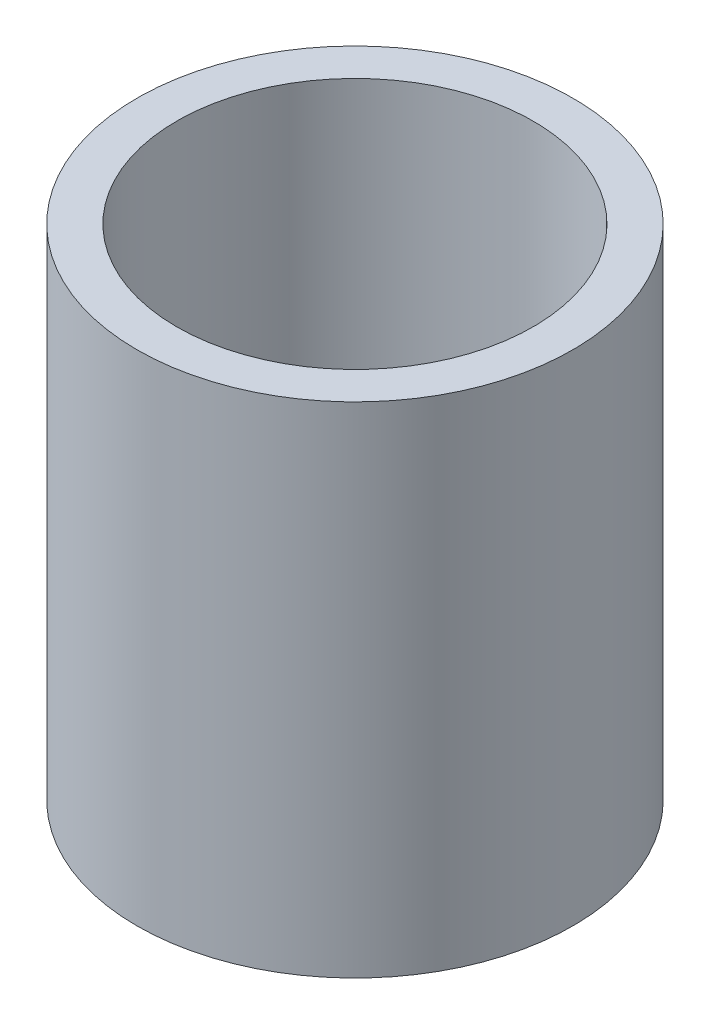
ISO-10303-21;
HEADER;
FILE_DESCRIPTION(('STEP AP214'),'2;1');
FILE_NAME('part.step','',(''),(''),'','','');
FILE_SCHEMA(('AUTOMOTIVE_DESIGN { 1 0 10303 214 1 1 1 1 }'));
ENDSEC;
DATA;
#1=APPLICATION_CONTEXT('core data for automotive mechanical design processes');
#2=APPLICATION_PROTOCOL_DEFINITION('international standard','automotive_design',2000,#1);
#3=PRODUCT_CONTEXT('',#1,'mechanical');
#4=PRODUCT('Part','Part','',(#3));
#5=PRODUCT_RELATED_PRODUCT_CATEGORY('part','',(#4));
#6=PRODUCT_DEFINITION_FORMATION('','',#4);
#7=PRODUCT_DEFINITION_CONTEXT('part definition',#1,'design');
#8=PRODUCT_DEFINITION('design','',#6,#7);
#9=PRODUCT_DEFINITION_SHAPE('','',#8);
#10=(LENGTH_UNIT() NAMED_UNIT(*) SI_UNIT(.MILLI.,.METRE.));
#11=(NAMED_UNIT(*) PLANE_ANGLE_UNIT() SI_UNIT($,.RADIAN.));
#12=(NAMED_UNIT(*) SI_UNIT($,.STERADIAN.) SOLID_ANGLE_UNIT());
#13=UNCERTAINTY_MEASURE_WITH_UNIT(LENGTH_MEASURE(1.E-05),#10,'distance_accuracy_value','');
#14=(GEOMETRIC_REPRESENTATION_CONTEXT(3) GLOBAL_UNCERTAINTY_ASSIGNED_CONTEXT((#13)) GLOBAL_UNIT_ASSIGNED_CONTEXT((#10,
#11,#12)) REPRESENTATION_CONTEXT('',''));
#15=CARTESIAN_POINT('',(0.,0.,0.));
#16=DIRECTION('',(0.,0.,1.));
#17=DIRECTION('',(1.,0.,0.));
#18=AXIS2_PLACEMENT_3D('',#15,#16,#17);
#19=CARTESIAN_POINT('',(0.,34.3403661005396,0.));
#20=DIRECTION('',(0.,-1.,0.));
#21=DIRECTION('',(0.,0.,-1.));
#22=AXIS2_PLACEMENT_3D('',#19,#20,#21);
#23=CYLINDRICAL_SURFACE('',#22,15.);
#24=CARTESIAN_POINT('',(0.,34.3403661005396,0.));
#25=DIRECTION('',(0.,1.,0.));
#26=DIRECTION('',(0.,0.,1.));
#27=AXIS2_PLACEMENT_3D('',#24,#25,#26);
#28=CIRCLE('',#27,15.);
#29=CARTESIAN_POINT('',(0.,34.3403661005396,15.));
#30=VERTEX_POINT('',#29);
#31=EDGE_CURVE('E10',#30,#30,#28,.T.);
#32=ORIENTED_EDGE('',*,*,#31,.F.);
#33=EDGE_LOOP('',(#32));
#34=FACE_BOUND('',#33,.T.);
#35=CARTESIAN_POINT('',(0.,0.,0.));
#36=DIRECTION('',(0.,1.,0.));
#37=DIRECTION('',(0.,0.,1.));
#38=AXIS2_PLACEMENT_3D('',#35,#36,#37);
#39=CIRCLE('',#38,15.);
#40=CARTESIAN_POINT('',(0.,0.,15.));
#41=VERTEX_POINT('',#40);
#42=EDGE_CURVE('E37',#41,#41,#39,.T.);
#43=ORIENTED_EDGE('',*,*,#42,.T.);
#44=EDGE_LOOP('',(#43));
#45=FACE_BOUND('',#44,.T.);
#46=ADVANCED_FACE('F40',(#34,#45),#23,.T.);
#47=CARTESIAN_POINT('',(0.,34.3403661005396,0.));
#48=DIRECTION('',(0.,1.,0.));
#49=DIRECTION('',(0.,0.,1.));
#50=AXIS2_PLACEMENT_3D('',#47,#48,#49);
#51=PLANE('',#50);
#52=CARTESIAN_POINT('',(0.,34.3403661005396,0.));
#53=DIRECTION('',(0.,1.,0.));
#54=DIRECTION('',(0.,0.,1.));
#55=AXIS2_PLACEMENT_3D('',#52,#53,#54);
#56=CIRCLE('',#55,12.2670807758447);
#57=CARTESIAN_POINT('',(0.,34.3403661005396,12.2670807758447));
#58=VERTEX_POINT('',#57);
#59=EDGE_CURVE('E50',#58,#58,#56,.T.);
#60=ORIENTED_EDGE('',*,*,#59,.F.);
#61=EDGE_LOOP('',(#60));
#62=FACE_BOUND('',#61,.T.);
#63=ORIENTED_EDGE('',*,*,#31,.T.);
#64=EDGE_LOOP('',(#63));
#65=FACE_BOUND('',#64,.T.);
#66=ADVANCED_FACE('F59',(#62,#65),#51,.T.);
#67=CARTESIAN_POINT('',(0.,0.,0.));
#68=DIRECTION('',(0.,1.,0.));
#69=DIRECTION('',(0.,0.,1.));
#70=AXIS2_PLACEMENT_3D('',#67,#68,#69);
#71=PLANE('',#70);
#72=CARTESIAN_POINT('',(0.,0.,0.));
#73=DIRECTION('',(0.,1.,0.));
#74=DIRECTION('',(0.,0.,1.));
#75=AXIS2_PLACEMENT_3D('',#72,#73,#74);
#76=CIRCLE('',#75,12.2670807758447);
#77=CARTESIAN_POINT('',(0.,0.,12.2670807758447));
#78=VERTEX_POINT('',#77);
#79=EDGE_CURVE('E47',#78,#78,#76,.T.);
#80=ORIENTED_EDGE('',*,*,#79,.T.);
#81=EDGE_LOOP('',(#80));
#82=FACE_BOUND('',#81,.T.);
#83=ORIENTED_EDGE('',*,*,#42,.F.);
#84=EDGE_LOOP('',(#83));
#85=FACE_BOUND('',#84,.T.);
#86=ADVANCED_FACE('F58',(#82,#85),#71,.F.);
#87=CARTESIAN_POINT('',(0.,34.3403661005396,0.));
#88=DIRECTION('',(0.,-1.,0.));
#89=DIRECTION('',(0.,0.,-1.));
#90=AXIS2_PLACEMENT_3D('',#87,#88,#89);
#91=CYLINDRICAL_SURFACE('',#90,12.2670807758447);
#92=ORIENTED_EDGE('',*,*,#59,.T.);
#93=EDGE_LOOP('',(#92));
#94=FACE_BOUND('',#93,.T.);
#95=ORIENTED_EDGE('',*,*,#79,.F.);
#96=EDGE_LOOP('',(#95));
#97=FACE_BOUND('',#96,.T.);
#98=ADVANCED_FACE('F54',(#94,#97),#91,.F.);
#99=CLOSED_SHELL('',(#46,#66,#86,#98));
#100=MANIFOLD_SOLID_BREP('B2',#99);
#101=ADVANCED_BREP_SHAPE_REPRESENTATION('',(#18,#100),#14);
#102=SHAPE_DEFINITION_REPRESENTATION(#9,#101);
ENDSEC;
END-ISO-10303-21;
